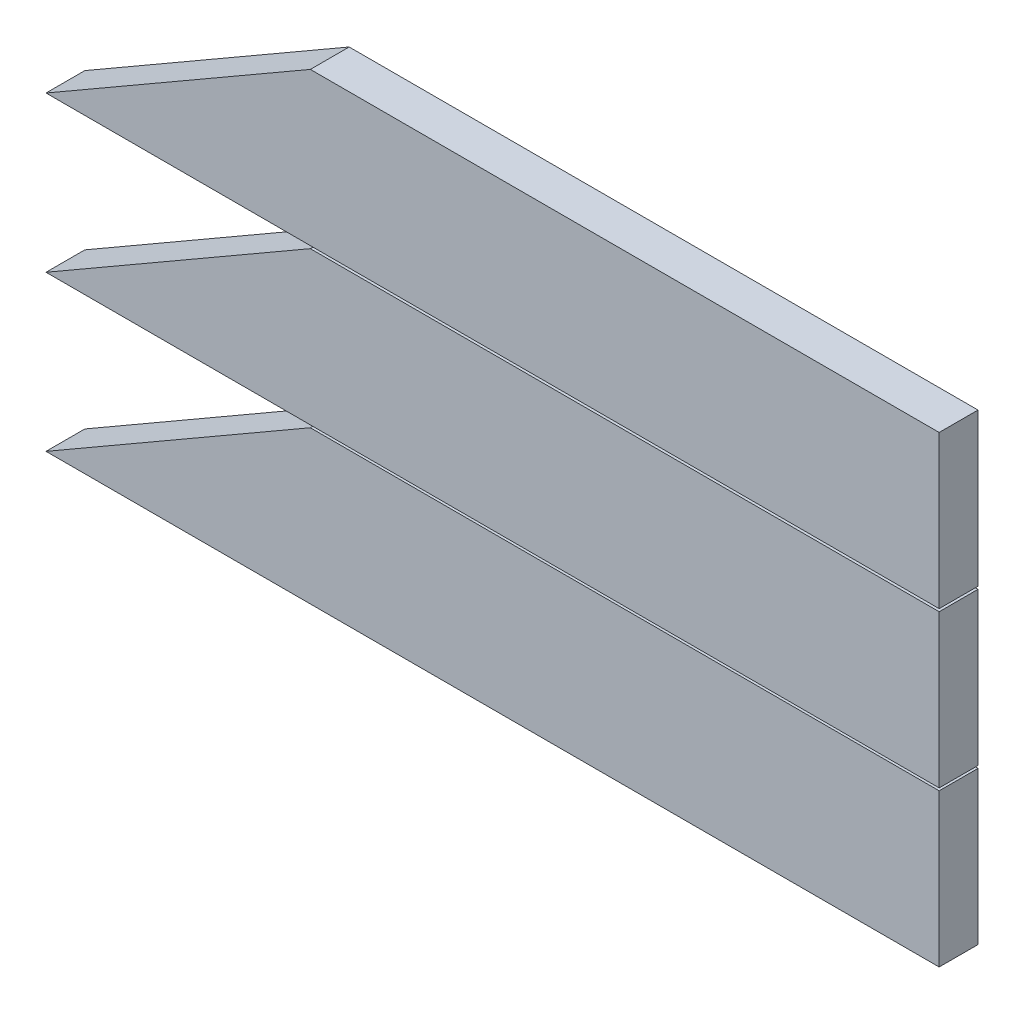
ISO-10303-21;
HEADER;
FILE_DESCRIPTION(('STEP AP214'),'2;1');
FILE_NAME('part.step','',(''),(''),'','','');
FILE_SCHEMA(('AUTOMOTIVE_DESIGN { 1 0 10303 214 1 1 1 1 }'));
ENDSEC;
DATA;
#1=APPLICATION_CONTEXT('core data for automotive mechanical design processes');
#2=APPLICATION_PROTOCOL_DEFINITION('international standard','automotive_design',2000,#1);
#3=PRODUCT_CONTEXT('',#1,'mechanical');
#4=PRODUCT('Part','Part','',(#3));
#5=PRODUCT_RELATED_PRODUCT_CATEGORY('part','',(#4));
#6=PRODUCT_DEFINITION_FORMATION('','',#4);
#7=PRODUCT_DEFINITION_CONTEXT('part definition',#1,'design');
#8=PRODUCT_DEFINITION('design','',#6,#7);
#9=PRODUCT_DEFINITION_SHAPE('','',#8);
#10=(LENGTH_UNIT() NAMED_UNIT(*) SI_UNIT(.MILLI.,.METRE.));
#11=(NAMED_UNIT(*) PLANE_ANGLE_UNIT() SI_UNIT($,.RADIAN.));
#12=(NAMED_UNIT(*) SI_UNIT($,.STERADIAN.) SOLID_ANGLE_UNIT());
#13=UNCERTAINTY_MEASURE_WITH_UNIT(LENGTH_MEASURE(1.E-05),#10,'distance_accuracy_value','');
#14=(GEOMETRIC_REPRESENTATION_CONTEXT(3) GLOBAL_UNCERTAINTY_ASSIGNED_CONTEXT((#13)) GLOBAL_UNIT_ASSIGNED_CONTEXT((#10,
#11,#12)) REPRESENTATION_CONTEXT('',''));
#15=CARTESIAN_POINT('',(0.,0.,0.));
#16=DIRECTION('',(0.,0.,1.));
#17=DIRECTION('',(1.,0.,0.));
#18=AXIS2_PLACEMENT_3D('',#15,#16,#17);
#19=CARTESIAN_POINT('',(0.,-201.267836193344,25.4));
#20=DIRECTION('',(0.,1.,0.));
#21=DIRECTION('',(0.,0.,1.));
#22=AXIS2_PLACEMENT_3D('',#19,#20,#21);
#23=PLANE('',#22);
#24=DIRECTION('',(1.,0.,0.));
#25=VECTOR('',#24,1.);
#26=CARTESIAN_POINT('',(0.,-201.267836193344,0.));
#27=LINE('',#26,#25);
#28=CARTESIAN_POINT('',(-584.2,-201.267836193345,0.));
#29=VERTEX_POINT('',#28);
#30=CARTESIAN_POINT('',(0.,-201.267836193344,0.));
#31=VERTEX_POINT('',#30);
#32=EDGE_CURVE('E120',#29,#31,#27,.T.);
#33=ORIENTED_EDGE('',*,*,#32,.T.);
#34=DIRECTION('',(0.,0.,-1.));
#35=VECTOR('',#34,1.);
#36=CARTESIAN_POINT('',(0.,-201.267836193344,25.4));
#37=LINE('',#36,#35);
#38=CARTESIAN_POINT('',(0.,-201.267836193344,25.4));
#39=VERTEX_POINT('',#38);
#40=EDGE_CURVE('E12',#39,#31,#37,.T.);
#41=ORIENTED_EDGE('',*,*,#40,.F.);
#42=DIRECTION('',(1.,0.,0.));
#43=VECTOR('',#42,1.);
#44=CARTESIAN_POINT('',(0.,-201.267836193344,25.4));
#45=LINE('',#44,#43);
#46=CARTESIAN_POINT('',(-584.2,-201.267836193345,25.4));
#47=VERTEX_POINT('',#46);
#48=EDGE_CURVE('E104',#47,#39,#45,.T.);
#49=ORIENTED_EDGE('',*,*,#48,.F.);
#50=DIRECTION('',(0.,0.,-1.));
#51=VECTOR('',#50,1.);
#52=CARTESIAN_POINT('',(-584.2,-201.267836193345,25.4));
#53=LINE('',#52,#51);
#54=EDGE_CURVE('E116',#47,#29,#53,.T.);
#55=ORIENTED_EDGE('',*,*,#54,.T.);
#56=EDGE_LOOP('',(#33,#41,#49,#55));
#57=FACE_BOUND('',#56,.T.);
#58=ADVANCED_FACE('F52',(#57),#23,.F.);
#59=CARTESIAN_POINT('',(0.,0.,25.4));
#60=DIRECTION('',(-1.,0.,0.));
#61=DIRECTION('',(0.,0.,1.));
#62=AXIS2_PLACEMENT_3D('',#59,#60,#61);
#63=PLANE('',#62);
#64=DIRECTION('',(0.,1.,0.));
#65=VECTOR('',#64,1.);
#66=CARTESIAN_POINT('',(0.,0.,0.));
#67=LINE('',#66,#65);
#68=CARTESIAN_POINT('',(0.,-101.445836193344,0.));
#69=VERTEX_POINT('',#68);
#70=EDGE_CURVE('E109',#31,#69,#67,.T.);
#71=ORIENTED_EDGE('',*,*,#70,.T.);
#72=DIRECTION('',(0.,0.,-1.));
#73=VECTOR('',#72,1.);
#74=CARTESIAN_POINT('',(0.,-101.445836193344,25.4));
#75=LINE('',#74,#73);
#76=CARTESIAN_POINT('',(0.,-101.445836193344,25.4));
#77=VERTEX_POINT('',#76);
#78=EDGE_CURVE('E61',#77,#69,#75,.T.);
#79=ORIENTED_EDGE('',*,*,#78,.F.);
#80=DIRECTION('',(0.,1.,0.));
#81=VECTOR('',#80,1.);
#82=CARTESIAN_POINT('',(0.,0.,25.4));
#83=LINE('',#82,#81);
#84=EDGE_CURVE('E99',#39,#77,#83,.T.);
#85=ORIENTED_EDGE('',*,*,#84,.F.);
#86=ORIENTED_EDGE('',*,*,#40,.T.);
#87=EDGE_LOOP('',(#71,#79,#85,#86));
#88=FACE_BOUND('',#87,.T.);
#89=ADVANCED_FACE('F108',(#88),#63,.F.);
#90=CARTESIAN_POINT('',(0.,-101.445836193344,25.4));
#91=DIRECTION('',(0.,-1.,0.));
#92=DIRECTION('',(1.,0.,0.));
#93=AXIS2_PLACEMENT_3D('',#90,#91,#92);
#94=PLANE('',#93);
#95=DIRECTION('',(-1.,0.,0.));
#96=VECTOR('',#95,1.);
#97=CARTESIAN_POINT('',(0.,-101.445836193344,0.));
#98=LINE('',#97,#96);
#99=CARTESIAN_POINT('',(-411.303224286857,-101.445836193344,0.));
#100=VERTEX_POINT('',#99);
#101=EDGE_CURVE('E86',#69,#100,#98,.T.);
#102=ORIENTED_EDGE('',*,*,#101,.T.);
#103=DIRECTION('',(0.,0.,-1.));
#104=VECTOR('',#103,1.);
#105=CARTESIAN_POINT('',(-411.303224286857,-101.445836193344,25.4));
#106=LINE('',#105,#104);
#107=CARTESIAN_POINT('',(-411.303224286857,-101.445836193344,25.4));
#108=VERTEX_POINT('',#107);
#109=EDGE_CURVE('E111',#108,#100,#106,.T.);
#110=ORIENTED_EDGE('',*,*,#109,.F.);
#111=DIRECTION('',(-1.,0.,0.));
#112=VECTOR('',#111,1.);
#113=CARTESIAN_POINT('',(0.,-101.445836193344,25.4));
#114=LINE('',#113,#112);
#115=EDGE_CURVE('E102',#77,#108,#114,.T.);
#116=ORIENTED_EDGE('',*,*,#115,.F.);
#117=ORIENTED_EDGE('',*,*,#78,.T.);
#118=EDGE_LOOP('',(#102,#110,#116,#117));
#119=FACE_BOUND('',#118,.T.);
#120=ADVANCED_FACE('F112',(#119),#94,.F.);
#121=CARTESIAN_POINT('',(-58.8984704459169,102.015143300423,25.4));
#122=DIRECTION('',(0.499999999999995,-0.866025403784442,0.));
#123=DIRECTION('',(0.866025403784442,0.499999999999995,0.));
#124=AXIS2_PLACEMENT_3D('',#121,#122,#123);
#125=PLANE('',#124);
#126=DIRECTION('',(-0.866025403784442,-0.499999999999995,0.));
#127=VECTOR('',#126,1.);
#128=CARTESIAN_POINT('',(-58.8984704459169,102.015143300423,0.));
#129=LINE('',#128,#127);
#130=EDGE_CURVE('E92',#100,#29,#129,.T.);
#131=ORIENTED_EDGE('',*,*,#130,.T.);
#132=ORIENTED_EDGE('',*,*,#54,.F.);
#133=DIRECTION('',(-0.866025403784442,-0.499999999999995,0.));
#134=VECTOR('',#133,1.);
#135=CARTESIAN_POINT('',(-58.8984704459169,102.015143300423,25.4));
#136=LINE('',#135,#134);
#137=EDGE_CURVE('E69',#108,#47,#136,.T.);
#138=ORIENTED_EDGE('',*,*,#137,.F.);
#139=ORIENTED_EDGE('',*,*,#109,.T.);
#140=EDGE_LOOP('',(#131,#132,#138,#139));
#141=FACE_BOUND('',#140,.T.);
#142=ADVANCED_FACE('F133',(#141),#125,.F.);
#143=CARTESIAN_POINT('',(0.,0.,25.4));
#144=DIRECTION('',(0.,0.,1.));
#145=DIRECTION('',(1.,0.,0.));
#146=AXIS2_PLACEMENT_3D('',#143,#144,#145);
#147=PLANE('',#146);
#148=ORIENTED_EDGE('',*,*,#48,.T.);
#149=ORIENTED_EDGE('',*,*,#84,.T.);
#150=ORIENTED_EDGE('',*,*,#115,.T.);
#151=ORIENTED_EDGE('',*,*,#137,.T.);
#152=EDGE_LOOP('',(#148,#149,#150,#151));
#153=FACE_BOUND('',#152,.T.);
#154=ADVANCED_FACE('F100',(#153),#147,.T.);
#155=CARTESIAN_POINT('',(0.,0.,0.));
#156=DIRECTION('',(0.,0.,1.));
#157=DIRECTION('',(1.,0.,0.));
#158=AXIS2_PLACEMENT_3D('',#155,#156,#157);
#159=PLANE('',#158);
#160=ORIENTED_EDGE('',*,*,#32,.F.);
#161=ORIENTED_EDGE('',*,*,#130,.F.);
#162=ORIENTED_EDGE('',*,*,#101,.F.);
#163=ORIENTED_EDGE('',*,*,#70,.F.);
#164=EDGE_LOOP('',(#160,#161,#162,#163));
#165=FACE_BOUND('',#164,.T.);
#166=ADVANCED_FACE('F136',(#165),#159,.F.);
#167=CLOSED_SHELL('',(#58,#89,#120,#142,#154,#166));
#168=MANIFOLD_SOLID_BREP('B2',#167);
#169=CARTESIAN_POINT('',(0.,-99.822,25.4));
#170=DIRECTION('',(0.,1.,0.));
#171=DIRECTION('',(0.,0.,1.));
#172=AXIS2_PLACEMENT_3D('',#169,#170,#171);
#173=PLANE('',#172);
#174=DIRECTION('',(1.,0.,0.));
#175=VECTOR('',#174,1.);
#176=CARTESIAN_POINT('',(0.,-99.822,0.));
#177=LINE('',#176,#175);
#178=CARTESIAN_POINT('',(-584.2,-99.8220000000001,0.));
#179=VERTEX_POINT('',#178);
#180=CARTESIAN_POINT('',(0.,-99.822,0.));
#181=VERTEX_POINT('',#180);
#182=EDGE_CURVE('E260',#179,#181,#177,.T.);
#183=ORIENTED_EDGE('',*,*,#182,.T.);
#184=DIRECTION('',(0.,0.,-1.));
#185=VECTOR('',#184,1.);
#186=CARTESIAN_POINT('',(0.,-99.822,25.4));
#187=LINE('',#186,#185);
#188=CARTESIAN_POINT('',(0.,-99.822,25.4));
#189=VERTEX_POINT('',#188);
#190=EDGE_CURVE('E50',#189,#181,#187,.T.);
#191=ORIENTED_EDGE('',*,*,#190,.F.);
#192=DIRECTION('',(1.,0.,0.));
#193=VECTOR('',#192,1.);
#194=CARTESIAN_POINT('',(0.,-99.822,25.4));
#195=LINE('',#194,#193);
#196=CARTESIAN_POINT('',(-584.2,-99.8220000000001,25.4));
#197=VERTEX_POINT('',#196);
#198=EDGE_CURVE('E248',#197,#189,#195,.T.);
#199=ORIENTED_EDGE('',*,*,#198,.F.);
#200=DIRECTION('',(0.,0.,-1.));
#201=VECTOR('',#200,1.);
#202=CARTESIAN_POINT('',(-584.2,-99.8220000000001,25.4));
#203=LINE('',#202,#201);
#204=EDGE_CURVE('E256',#197,#179,#203,.T.);
#205=ORIENTED_EDGE('',*,*,#204,.T.);
#206=EDGE_LOOP('',(#183,#191,#199,#205));
#207=FACE_BOUND('',#206,.T.);
#208=ADVANCED_FACE('F197',(#207),#173,.F.);
#209=CARTESIAN_POINT('',(0.,0.,25.4));
#210=DIRECTION('',(-1.,0.,0.));
#211=DIRECTION('',(0.,0.,1.));
#212=AXIS2_PLACEMENT_3D('',#209,#210,#211);
#213=PLANE('',#212);
#214=DIRECTION('',(0.,1.,0.));
#215=VECTOR('',#214,1.);
#216=CARTESIAN_POINT('',(0.,0.,0.));
#217=LINE('',#216,#215);
#218=CARTESIAN_POINT('',(0.,0.,0.));
#219=VERTEX_POINT('',#218);
#220=EDGE_CURVE('E252',#181,#219,#217,.T.);
#221=ORIENTED_EDGE('',*,*,#220,.T.);
#222=DIRECTION('',(0.,0.,-1.));
#223=VECTOR('',#222,1.);
#224=CARTESIAN_POINT('',(0.,0.,25.4));
#225=LINE('',#224,#223);
#226=CARTESIAN_POINT('',(0.,0.,25.4));
#227=VERTEX_POINT('',#226);
#228=EDGE_CURVE('E205',#227,#219,#225,.T.);
#229=ORIENTED_EDGE('',*,*,#228,.F.);
#230=DIRECTION('',(0.,1.,0.));
#231=VECTOR('',#230,1.);
#232=CARTESIAN_POINT('',(0.,0.,25.4));
#233=LINE('',#232,#231);
#234=EDGE_CURVE('E243',#189,#227,#233,.T.);
#235=ORIENTED_EDGE('',*,*,#234,.F.);
#236=ORIENTED_EDGE('',*,*,#190,.T.);
#237=EDGE_LOOP('',(#221,#229,#235,#236));
#238=FACE_BOUND('',#237,.T.);
#239=ADVANCED_FACE('F251',(#238),#213,.F.);
#240=CARTESIAN_POINT('',(0.,0.,25.4));
#241=DIRECTION('',(0.,-1.,0.));
#242=DIRECTION('',(1.,0.,0.));
#243=AXIS2_PLACEMENT_3D('',#240,#241,#242);
#244=PLANE('',#243);
#245=DIRECTION('',(-1.,0.,0.));
#246=VECTOR('',#245,1.);
#247=CARTESIAN_POINT('',(0.,0.,0.));
#248=LINE('',#247,#246);
#249=CARTESIAN_POINT('',(-411.303224286857,0.,0.));
#250=VERTEX_POINT('',#249);
#251=EDGE_CURVE('E230',#219,#250,#248,.T.);
#252=ORIENTED_EDGE('',*,*,#251,.T.);
#253=DIRECTION('',(0.,0.,-1.));
#254=VECTOR('',#253,1.);
#255=CARTESIAN_POINT('',(-411.303224286857,0.,25.4));
#256=LINE('',#255,#254);
#257=CARTESIAN_POINT('',(-411.303224286857,0.,25.4));
#258=VERTEX_POINT('',#257);
#259=EDGE_CURVE('E253',#258,#250,#256,.T.);
#260=ORIENTED_EDGE('',*,*,#259,.F.);
#261=DIRECTION('',(-1.,0.,0.));
#262=VECTOR('',#261,1.);
#263=CARTESIAN_POINT('',(0.,0.,25.4));
#264=LINE('',#263,#262);
#265=EDGE_CURVE('E246',#227,#258,#264,.T.);
#266=ORIENTED_EDGE('',*,*,#265,.F.);
#267=ORIENTED_EDGE('',*,*,#228,.T.);
#268=EDGE_LOOP('',(#252,#260,#266,#267));
#269=FACE_BOUND('',#268,.T.);
#270=ADVANCED_FACE('F254',(#269),#244,.F.);
#271=CARTESIAN_POINT('',(-102.825806071712,178.099520445432,25.4));
#272=DIRECTION('',(0.499999999999995,-0.866025403784442,0.));
#273=DIRECTION('',(0.866025403784442,0.499999999999995,0.));
#274=AXIS2_PLACEMENT_3D('',#271,#272,#273);
#275=PLANE('',#274);
#276=DIRECTION('',(-0.866025403784442,-0.499999999999995,0.));
#277=VECTOR('',#276,1.);
#278=CARTESIAN_POINT('',(-102.825806071712,178.099520445432,0.));
#279=LINE('',#278,#277);
#280=EDGE_CURVE('E236',#250,#179,#279,.T.);
#281=ORIENTED_EDGE('',*,*,#280,.T.);
#282=ORIENTED_EDGE('',*,*,#204,.F.);
#283=DIRECTION('',(-0.866025403784442,-0.499999999999995,0.));
#284=VECTOR('',#283,1.);
#285=CARTESIAN_POINT('',(-102.825806071712,178.099520445432,25.4));
#286=LINE('',#285,#284);
#287=EDGE_CURVE('E213',#258,#197,#286,.T.);
#288=ORIENTED_EDGE('',*,*,#287,.F.);
#289=ORIENTED_EDGE('',*,*,#259,.T.);
#290=EDGE_LOOP('',(#281,#282,#288,#289));
#291=FACE_BOUND('',#290,.T.);
#292=ADVANCED_FACE('F267',(#291),#275,.F.);
#293=CARTESIAN_POINT('',(0.,0.,25.4));
#294=DIRECTION('',(0.,0.,1.));
#295=DIRECTION('',(1.,0.,0.));
#296=AXIS2_PLACEMENT_3D('',#293,#294,#295);
#297=PLANE('',#296);
#298=ORIENTED_EDGE('',*,*,#198,.T.);
#299=ORIENTED_EDGE('',*,*,#234,.T.);
#300=ORIENTED_EDGE('',*,*,#265,.T.);
#301=ORIENTED_EDGE('',*,*,#287,.T.);
#302=EDGE_LOOP('',(#298,#299,#300,#301));
#303=FACE_BOUND('',#302,.T.);
#304=ADVANCED_FACE('F244',(#303),#297,.T.);
#305=CARTESIAN_POINT('',(0.,0.,0.));
#306=DIRECTION('',(0.,0.,1.));
#307=DIRECTION('',(1.,0.,0.));
#308=AXIS2_PLACEMENT_3D('',#305,#306,#307);
#309=PLANE('',#308);
#310=ORIENTED_EDGE('',*,*,#182,.F.);
#311=ORIENTED_EDGE('',*,*,#280,.F.);
#312=ORIENTED_EDGE('',*,*,#251,.F.);
#313=ORIENTED_EDGE('',*,*,#220,.F.);
#314=EDGE_LOOP('',(#310,#311,#312,#313));
#315=FACE_BOUND('',#314,.T.);
#316=ADVANCED_FACE('F270',(#315),#309,.F.);
#317=CLOSED_SHELL('',(#208,#239,#270,#292,#304,#316));
#318=MANIFOLD_SOLID_BREP('B6',#317);
#319=CARTESIAN_POINT('',(0.,1.71769107199028,25.4));
#320=DIRECTION('',(0.,1.,0.));
#321=DIRECTION('',(0.,0.,1.));
#322=AXIS2_PLACEMENT_3D('',#319,#320,#321);
#323=PLANE('',#322);
#324=DIRECTION('',(1.,0.,0.));
#325=VECTOR('',#324,1.);
#326=CARTESIAN_POINT('',(0.,1.71769107199028,0.));
#327=LINE('',#326,#325);
#328=CARTESIAN_POINT('',(-584.2,1.71769107199021,0.));
#329=VERTEX_POINT('',#328);
#330=CARTESIAN_POINT('',(0.,1.71769107199028,0.));
#331=VERTEX_POINT('',#330);
#332=EDGE_CURVE('E384',#329,#331,#327,.T.);
#333=ORIENTED_EDGE('',*,*,#332,.T.);
#334=DIRECTION('',(0.,0.,-1.));
#335=VECTOR('',#334,1.);
#336=CARTESIAN_POINT('',(0.,1.71769107199028,25.4));
#337=LINE('',#336,#335);
#338=CARTESIAN_POINT('',(0.,1.71769107199028,25.4));
#339=VERTEX_POINT('',#338);
#340=EDGE_CURVE('E195',#339,#331,#337,.T.);
#341=ORIENTED_EDGE('',*,*,#340,.F.);
#342=DIRECTION('',(1.,0.,0.));
#343=VECTOR('',#342,1.);
#344=CARTESIAN_POINT('',(0.,1.71769107199028,25.4));
#345=LINE('',#344,#343);
#346=CARTESIAN_POINT('',(-584.2,1.71769107199021,25.4));
#347=VERTEX_POINT('',#346);
#348=EDGE_CURVE('E372',#347,#339,#345,.T.);
#349=ORIENTED_EDGE('',*,*,#348,.F.);
#350=DIRECTION('',(0.,0.,-1.));
#351=VECTOR('',#350,1.);
#352=CARTESIAN_POINT('',(-584.2,1.71769107199021,25.4));
#353=LINE('',#352,#351);
#354=EDGE_CURVE('E380',#347,#329,#353,.T.);
#355=ORIENTED_EDGE('',*,*,#354,.T.);
#356=EDGE_LOOP('',(#333,#341,#349,#355));
#357=FACE_BOUND('',#356,.T.);
#358=ADVANCED_FACE('F321',(#357),#323,.F.);
#359=CARTESIAN_POINT('',(0.,0.,25.4));
#360=DIRECTION('',(-1.,0.,0.));
#361=DIRECTION('',(0.,0.,1.));
#362=AXIS2_PLACEMENT_3D('',#359,#360,#361);
#363=PLANE('',#362);
#364=DIRECTION('',(0.,1.,0.));
#365=VECTOR('',#364,1.);
#366=CARTESIAN_POINT('',(0.,0.,0.));
#367=LINE('',#366,#365);
#368=CARTESIAN_POINT('',(0.,101.53969107199,0.));
#369=VERTEX_POINT('',#368);
#370=EDGE_CURVE('E376',#331,#369,#367,.T.);
#371=ORIENTED_EDGE('',*,*,#370,.T.);
#372=DIRECTION('',(0.,0.,-1.));
#373=VECTOR('',#372,1.);
#374=CARTESIAN_POINT('',(0.,101.53969107199,25.4));
#375=LINE('',#374,#373);
#376=CARTESIAN_POINT('',(0.,101.53969107199,25.4));
#377=VERTEX_POINT('',#376);
#378=EDGE_CURVE('E329',#377,#369,#375,.T.);
#379=ORIENTED_EDGE('',*,*,#378,.F.);
#380=DIRECTION('',(0.,1.,0.));
#381=VECTOR('',#380,1.);
#382=CARTESIAN_POINT('',(0.,0.,25.4));
#383=LINE('',#382,#381);
#384=EDGE_CURVE('E367',#339,#377,#383,.T.);
#385=ORIENTED_EDGE('',*,*,#384,.F.);
#386=ORIENTED_EDGE('',*,*,#340,.T.);
#387=EDGE_LOOP('',(#371,#379,#385,#386));
#388=FACE_BOUND('',#387,.T.);
#389=ADVANCED_FACE('F375',(#388),#363,.F.);
#390=CARTESIAN_POINT('',(0.,101.53969107199,25.4));
#391=DIRECTION('',(0.,-1.,0.));
#392=DIRECTION('',(1.,0.,0.));
#393=AXIS2_PLACEMENT_3D('',#390,#391,#392);
#394=PLANE('',#393);
#395=DIRECTION('',(-1.,0.,0.));
#396=VECTOR('',#395,1.);
#397=CARTESIAN_POINT('',(0.,101.53969107199,0.));
#398=LINE('',#397,#396);
#399=CARTESIAN_POINT('',(-411.303224286857,101.53969107199,0.));
#400=VERTEX_POINT('',#399);
#401=EDGE_CURVE('E354',#369,#400,#398,.T.);
#402=ORIENTED_EDGE('',*,*,#401,.T.);
#403=DIRECTION('',(0.,0.,-1.));
#404=VECTOR('',#403,1.);
#405=CARTESIAN_POINT('',(-411.303224286857,101.53969107199,25.4));
#406=LINE('',#405,#404);
#407=CARTESIAN_POINT('',(-411.303224286857,101.53969107199,25.4));
#408=VERTEX_POINT('',#407);
#409=EDGE_CURVE('E377',#408,#400,#406,.T.);
#410=ORIENTED_EDGE('',*,*,#409,.F.);
#411=DIRECTION('',(-1.,0.,0.));
#412=VECTOR('',#411,1.);
#413=CARTESIAN_POINT('',(0.,101.53969107199,25.4));
#414=LINE('',#413,#412);
#415=EDGE_CURVE('E370',#377,#408,#414,.T.);
#416=ORIENTED_EDGE('',*,*,#415,.F.);
#417=ORIENTED_EDGE('',*,*,#378,.T.);
#418=EDGE_LOOP('',(#402,#410,#416,#417));
#419=FACE_BOUND('',#418,.T.);
#420=ADVANCED_FACE('F378',(#419),#394,.F.);
#421=CARTESIAN_POINT('',(-146.793782052096,254.254288749425,25.4));
#422=DIRECTION('',(0.499999999999995,-0.866025403784442,0.));
#423=DIRECTION('',(0.866025403784442,0.499999999999995,0.));
#424=AXIS2_PLACEMENT_3D('',#421,#422,#423);
#425=PLANE('',#424);
#426=DIRECTION('',(-0.866025403784442,-0.499999999999995,0.));
#427=VECTOR('',#426,1.);
#428=CARTESIAN_POINT('',(-146.793782052096,254.254288749425,0.));
#429=LINE('',#428,#427);
#430=EDGE_CURVE('E360',#400,#329,#429,.T.);
#431=ORIENTED_EDGE('',*,*,#430,.T.);
#432=ORIENTED_EDGE('',*,*,#354,.F.);
#433=DIRECTION('',(-0.866025403784442,-0.499999999999995,0.));
#434=VECTOR('',#433,1.);
#435=CARTESIAN_POINT('',(-146.793782052096,254.254288749425,25.4));
#436=LINE('',#435,#434);
#437=EDGE_CURVE('E337',#408,#347,#436,.T.);
#438=ORIENTED_EDGE('',*,*,#437,.F.);
#439=ORIENTED_EDGE('',*,*,#409,.T.);
#440=EDGE_LOOP('',(#431,#432,#438,#439));
#441=FACE_BOUND('',#440,.T.);
#442=ADVANCED_FACE('F391',(#441),#425,.F.);
#443=CARTESIAN_POINT('',(0.,0.,25.4));
#444=DIRECTION('',(0.,0.,1.));
#445=DIRECTION('',(1.,0.,0.));
#446=AXIS2_PLACEMENT_3D('',#443,#444,#445);
#447=PLANE('',#446);
#448=ORIENTED_EDGE('',*,*,#348,.T.);
#449=ORIENTED_EDGE('',*,*,#384,.T.);
#450=ORIENTED_EDGE('',*,*,#415,.T.);
#451=ORIENTED_EDGE('',*,*,#437,.T.);
#452=EDGE_LOOP('',(#448,#449,#450,#451));
#453=FACE_BOUND('',#452,.T.);
#454=ADVANCED_FACE('F368',(#453),#447,.T.);
#455=CARTESIAN_POINT('',(0.,0.,0.));
#456=DIRECTION('',(0.,0.,1.));
#457=DIRECTION('',(1.,0.,0.));
#458=AXIS2_PLACEMENT_3D('',#455,#456,#457);
#459=PLANE('',#458);
#460=ORIENTED_EDGE('',*,*,#332,.F.);
#461=ORIENTED_EDGE('',*,*,#430,.F.);
#462=ORIENTED_EDGE('',*,*,#401,.F.);
#463=ORIENTED_EDGE('',*,*,#370,.F.);
#464=EDGE_LOOP('',(#460,#461,#462,#463));
#465=FACE_BOUND('',#464,.T.);
#466=ADVANCED_FACE('F394',(#465),#459,.F.);
#467=CLOSED_SHELL('',(#358,#389,#420,#442,#454,#466));
#468=MANIFOLD_SOLID_BREP('B44',#467);
#469=ADVANCED_BREP_SHAPE_REPRESENTATION('',(#18,#168,#318,#468),#14);
#470=SHAPE_DEFINITION_REPRESENTATION(#9,#469);
ENDSEC;
END-ISO-10303-21;
